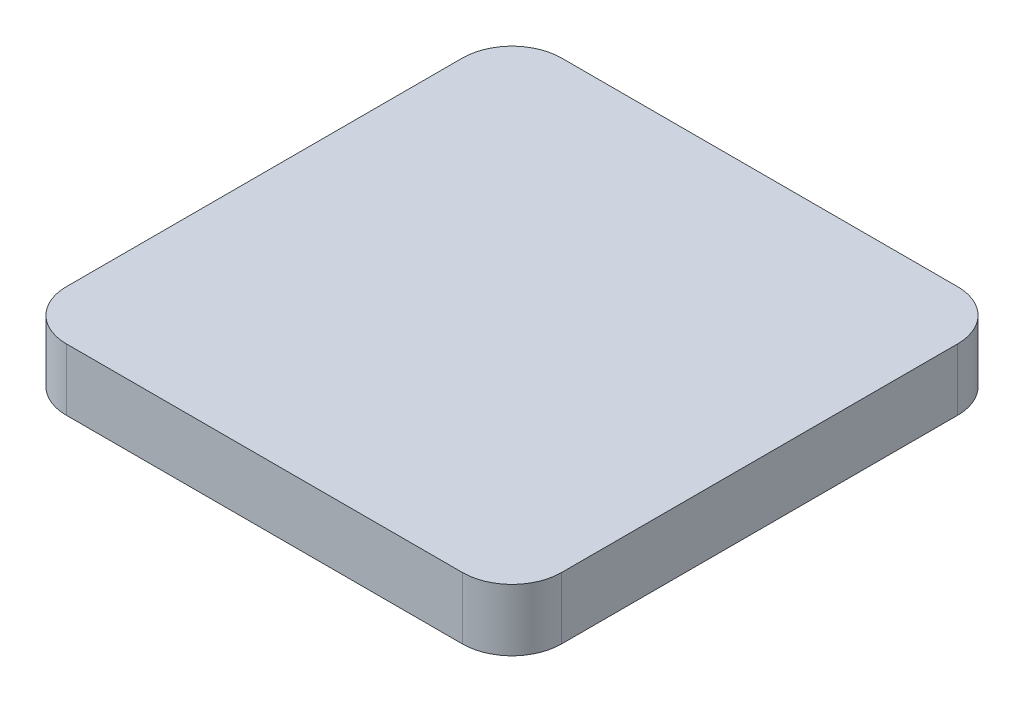
ISO-10303-21;
HEADER;
FILE_DESCRIPTION(('STEP AP214'),'2;1');
FILE_NAME('part.step','',(''),(''),'','','');
FILE_SCHEMA(('AUTOMOTIVE_DESIGN { 1 0 10303 214 1 1 1 1 }'));
ENDSEC;
DATA;
#1=APPLICATION_CONTEXT('core data for automotive mechanical design processes');
#2=APPLICATION_PROTOCOL_DEFINITION('international standard','automotive_design',2000,#1);
#3=PRODUCT_CONTEXT('',#1,'mechanical');
#4=PRODUCT('Part','Part','',(#3));
#5=PRODUCT_RELATED_PRODUCT_CATEGORY('part','',(#4));
#6=PRODUCT_DEFINITION_FORMATION('','',#4);
#7=PRODUCT_DEFINITION_CONTEXT('part definition',#1,'design');
#8=PRODUCT_DEFINITION('design','',#6,#7);
#9=PRODUCT_DEFINITION_SHAPE('','',#8);
#10=(LENGTH_UNIT() NAMED_UNIT(*) SI_UNIT(.MILLI.,.METRE.));
#11=(NAMED_UNIT(*) PLANE_ANGLE_UNIT() SI_UNIT($,.RADIAN.));
#12=(NAMED_UNIT(*) SI_UNIT($,.STERADIAN.) SOLID_ANGLE_UNIT());
#13=UNCERTAINTY_MEASURE_WITH_UNIT(LENGTH_MEASURE(1.E-05),#10,'distance_accuracy_value','');
#14=(GEOMETRIC_REPRESENTATION_CONTEXT(3) GLOBAL_UNCERTAINTY_ASSIGNED_CONTEXT((#13)) GLOBAL_UNIT_ASSIGNED_CONTEXT((#10,
#11,#12)) REPRESENTATION_CONTEXT('',''));
#15=CARTESIAN_POINT('',(0.,0.,0.));
#16=DIRECTION('',(0.,0.,1.));
#17=DIRECTION('',(1.,0.,0.));
#18=AXIS2_PLACEMENT_3D('',#15,#16,#17);
#19=CARTESIAN_POINT('',(12.7,3.175,-12.7));
#20=DIRECTION('',(-1.,0.,0.));
#21=DIRECTION('',(0.,0.,1.));
#22=AXIS2_PLACEMENT_3D('',#19,#20,#21);
#23=PLANE('',#22);
#24=DIRECTION('',(0.,0.,-1.));
#25=VECTOR('',#24,1.);
#26=CARTESIAN_POINT('',(12.7,0.,-12.7));
#27=LINE('',#26,#25);
#28=CARTESIAN_POINT('',(12.7,0.,10.16));
#29=VERTEX_POINT('',#28);
#30=CARTESIAN_POINT('',(12.7,0.,-10.16));
#31=VERTEX_POINT('',#30);
#32=EDGE_CURVE('E128',#29,#31,#27,.T.);
#33=ORIENTED_EDGE('',*,*,#32,.T.);
#34=DIRECTION('',(0.,-1.,0.));
#35=VECTOR('',#34,1.);
#36=CARTESIAN_POINT('',(12.7,3.175,-10.16));
#37=LINE('',#36,#35);
#38=CARTESIAN_POINT('',(12.7,3.175,-10.16));
#39=VERTEX_POINT('',#38);
#40=EDGE_CURVE('E106',#31,#39,#37,.F.);
#41=ORIENTED_EDGE('',*,*,#40,.T.);
#42=DIRECTION('',(0.,0.,-1.));
#43=VECTOR('',#42,1.);
#44=CARTESIAN_POINT('',(12.7,3.175,-12.7));
#45=LINE('',#44,#43);
#46=CARTESIAN_POINT('',(12.7,3.175,10.16));
#47=VERTEX_POINT('',#46);
#48=EDGE_CURVE('E137',#47,#39,#45,.T.);
#49=ORIENTED_EDGE('',*,*,#48,.F.);
#50=DIRECTION('',(0.,-1.,0.));
#51=VECTOR('',#50,1.);
#52=CARTESIAN_POINT('',(12.7,3.175,10.16));
#53=LINE('',#52,#51);
#54=EDGE_CURVE('E111',#47,#29,#53,.T.);
#55=ORIENTED_EDGE('',*,*,#54,.T.);
#56=EDGE_LOOP('',(#33,#41,#49,#55));
#57=FACE_BOUND('',#56,.T.);
#58=ADVANCED_FACE('F35',(#57),#23,.F.);
#59=CARTESIAN_POINT('',(-12.7,3.175,-12.7));
#60=DIRECTION('',(0.,0.,1.));
#61=DIRECTION('',(1.,0.,0.));
#62=AXIS2_PLACEMENT_3D('',#59,#60,#61);
#63=PLANE('',#62);
#64=DIRECTION('',(-1.,0.,0.));
#65=VECTOR('',#64,1.);
#66=CARTESIAN_POINT('',(-12.7,3.175,-12.7));
#67=LINE('',#66,#65);
#68=CARTESIAN_POINT('',(10.16,3.175,-12.7));
#69=VERTEX_POINT('',#68);
#70=CARTESIAN_POINT('',(-10.16,3.175,-12.7));
#71=VERTEX_POINT('',#70);
#72=EDGE_CURVE('E121',#69,#71,#67,.T.);
#73=ORIENTED_EDGE('',*,*,#72,.F.);
#74=DIRECTION('',(0.,-1.,0.));
#75=VECTOR('',#74,1.);
#76=CARTESIAN_POINT('',(10.16,3.175,-12.7));
#77=LINE('',#76,#75);
#78=CARTESIAN_POINT('',(10.16,0.,-12.7));
#79=VERTEX_POINT('',#78);
#80=EDGE_CURVE('E105',#69,#79,#77,.T.);
#81=ORIENTED_EDGE('',*,*,#80,.T.);
#82=DIRECTION('',(-1.,0.,0.));
#83=VECTOR('',#82,1.);
#84=CARTESIAN_POINT('',(-12.7,0.,-12.7));
#85=LINE('',#84,#83);
#86=CARTESIAN_POINT('',(-10.16,0.,-12.7));
#87=VERTEX_POINT('',#86);
#88=EDGE_CURVE('E118',#79,#87,#85,.T.);
#89=ORIENTED_EDGE('',*,*,#88,.T.);
#90=DIRECTION('',(0.,-1.,0.));
#91=VECTOR('',#90,1.);
#92=CARTESIAN_POINT('',(-10.16,3.175,-12.7));
#93=LINE('',#92,#91);
#94=EDGE_CURVE('E123',#87,#71,#93,.F.);
#95=ORIENTED_EDGE('',*,*,#94,.T.);
#96=EDGE_LOOP('',(#73,#81,#89,#95));
#97=FACE_BOUND('',#96,.T.);
#98=ADVANCED_FACE('F117',(#97),#63,.F.);
#99=CARTESIAN_POINT('',(-12.7,3.175,-12.7));
#100=DIRECTION('',(1.,0.,0.));
#101=DIRECTION('',(0.,0.,-1.));
#102=AXIS2_PLACEMENT_3D('',#99,#100,#101);
#103=PLANE('',#102);
#104=DIRECTION('',(0.,0.,1.));
#105=VECTOR('',#104,1.);
#106=CARTESIAN_POINT('',(-12.7,3.175,-12.7));
#107=LINE('',#106,#105);
#108=CARTESIAN_POINT('',(-12.7,3.175,-10.16));
#109=VERTEX_POINT('',#108);
#110=CARTESIAN_POINT('',(-12.7,3.175,10.16));
#111=VERTEX_POINT('',#110);
#112=EDGE_CURVE('E163',#109,#111,#107,.T.);
#113=ORIENTED_EDGE('',*,*,#112,.F.);
#114=DIRECTION('',(0.,-1.,0.));
#115=VECTOR('',#114,1.);
#116=CARTESIAN_POINT('',(-12.7,3.175,-10.16));
#117=LINE('',#116,#115);
#118=CARTESIAN_POINT('',(-12.7,0.,-10.16));
#119=VERTEX_POINT('',#118);
#120=EDGE_CURVE('E156',#109,#119,#117,.T.);
#121=ORIENTED_EDGE('',*,*,#120,.T.);
#122=DIRECTION('',(0.,0.,1.));
#123=VECTOR('',#122,1.);
#124=CARTESIAN_POINT('',(-12.7,0.,-12.7));
#125=LINE('',#124,#123);
#126=CARTESIAN_POINT('',(-12.7,0.,10.16));
#127=VERTEX_POINT('',#126);
#128=EDGE_CURVE('E127',#119,#127,#125,.T.);
#129=ORIENTED_EDGE('',*,*,#128,.T.);
#130=DIRECTION('',(0.,-1.,0.));
#131=VECTOR('',#130,1.);
#132=CARTESIAN_POINT('',(-12.7,3.175,10.16));
#133=LINE('',#132,#131);
#134=EDGE_CURVE('E154',#127,#111,#133,.F.);
#135=ORIENTED_EDGE('',*,*,#134,.T.);
#136=EDGE_LOOP('',(#113,#121,#129,#135));
#137=FACE_BOUND('',#136,.T.);
#138=ADVANCED_FACE('F161',(#137),#103,.F.);
#139=CARTESIAN_POINT('',(-12.7,3.175,12.7));
#140=DIRECTION('',(0.,0.,-1.));
#141=DIRECTION('',(-1.,0.,0.));
#142=AXIS2_PLACEMENT_3D('',#139,#140,#141);
#143=PLANE('',#142);
#144=DIRECTION('',(1.,0.,0.));
#145=VECTOR('',#144,1.);
#146=CARTESIAN_POINT('',(-12.7,3.175,12.7));
#147=LINE('',#146,#145);
#148=CARTESIAN_POINT('',(-10.16,3.175,12.7));
#149=VERTEX_POINT('',#148);
#150=CARTESIAN_POINT('',(10.16,3.175,12.7));
#151=VERTEX_POINT('',#150);
#152=EDGE_CURVE('E138',#149,#151,#147,.T.);
#153=ORIENTED_EDGE('',*,*,#152,.F.);
#154=DIRECTION('',(0.,-1.,0.));
#155=VECTOR('',#154,1.);
#156=CARTESIAN_POINT('',(-10.16,3.175,12.7));
#157=LINE('',#156,#155);
#158=CARTESIAN_POINT('',(-10.16,0.,12.7));
#159=VERTEX_POINT('',#158);
#160=EDGE_CURVE('E11',#149,#159,#157,.T.);
#161=ORIENTED_EDGE('',*,*,#160,.T.);
#162=DIRECTION('',(1.,0.,0.));
#163=VECTOR('',#162,1.);
#164=CARTESIAN_POINT('',(-12.7,0.,12.7));
#165=LINE('',#164,#163);
#166=CARTESIAN_POINT('',(10.16,0.,12.7));
#167=VERTEX_POINT('',#166);
#168=EDGE_CURVE('E131',#159,#167,#165,.T.);
#169=ORIENTED_EDGE('',*,*,#168,.T.);
#170=DIRECTION('',(0.,-1.,0.));
#171=VECTOR('',#170,1.);
#172=CARTESIAN_POINT('',(10.16,3.175,12.7));
#173=LINE('',#172,#171);
#174=EDGE_CURVE('E43',#167,#151,#173,.F.);
#175=ORIENTED_EDGE('',*,*,#174,.T.);
#176=EDGE_LOOP('',(#153,#161,#169,#175));
#177=FACE_BOUND('',#176,.T.);
#178=ADVANCED_FACE('F170',(#177),#143,.F.);
#179=CARTESIAN_POINT('',(0.,3.175,0.));
#180=DIRECTION('',(0.,1.,0.));
#181=DIRECTION('',(0.,0.,1.));
#182=AXIS2_PLACEMENT_3D('',#179,#180,#181);
#183=PLANE('',#182);
#184=ORIENTED_EDGE('',*,*,#48,.T.);
#185=CARTESIAN_POINT('',(10.16,3.175,-10.16));
#186=DIRECTION('',(0.,1.,0.));
#187=DIRECTION('',(0.,0.,1.));
#188=AXIS2_PLACEMENT_3D('',#185,#186,#187);
#189=CIRCLE('',#188,2.54);
#190=EDGE_CURVE('E152',#39,#69,#189,.T.);
#191=ORIENTED_EDGE('',*,*,#190,.T.);
#192=ORIENTED_EDGE('',*,*,#72,.T.);
#193=CARTESIAN_POINT('',(-10.16,3.175,-10.16));
#194=DIRECTION('',(0.,1.,0.));
#195=DIRECTION('',(0.,0.,1.));
#196=AXIS2_PLACEMENT_3D('',#193,#194,#195);
#197=CIRCLE('',#196,2.54);
#198=EDGE_CURVE('E150',#71,#109,#197,.T.);
#199=ORIENTED_EDGE('',*,*,#198,.T.);
#200=ORIENTED_EDGE('',*,*,#112,.T.);
#201=CARTESIAN_POINT('',(-10.16,3.175,10.16));
#202=DIRECTION('',(0.,1.,0.));
#203=DIRECTION('',(0.,0.,1.));
#204=AXIS2_PLACEMENT_3D('',#201,#202,#203);
#205=CIRCLE('',#204,2.54);
#206=EDGE_CURVE('E56',#111,#149,#205,.T.);
#207=ORIENTED_EDGE('',*,*,#206,.T.);
#208=ORIENTED_EDGE('',*,*,#152,.T.);
#209=CARTESIAN_POINT('',(10.16,3.175,10.16));
#210=DIRECTION('',(0.,1.,0.));
#211=DIRECTION('',(0.,0.,1.));
#212=AXIS2_PLACEMENT_3D('',#209,#210,#211);
#213=CIRCLE('',#212,2.54);
#214=EDGE_CURVE('E147',#151,#47,#213,.T.);
#215=ORIENTED_EDGE('',*,*,#214,.T.);
#216=EDGE_LOOP('',(#184,#191,#192,#199,#200,#207,#208,#215));
#217=FACE_BOUND('',#216,.T.);
#218=ADVANCED_FACE('F177',(#217),#183,.T.);
#219=CARTESIAN_POINT('',(0.,0.,0.));
#220=DIRECTION('',(0.,1.,0.));
#221=DIRECTION('',(0.,0.,1.));
#222=AXIS2_PLACEMENT_3D('',#219,#220,#221);
#223=PLANE('',#222);
#224=ORIENTED_EDGE('',*,*,#88,.F.);
#225=CARTESIAN_POINT('',(10.16,0.,-10.16));
#226=DIRECTION('',(0.,1.,0.));
#227=DIRECTION('',(0.,0.,1.));
#228=AXIS2_PLACEMENT_3D('',#225,#226,#227);
#229=CIRCLE('',#228,2.54);
#230=EDGE_CURVE('E101',#79,#31,#229,.F.);
#231=ORIENTED_EDGE('',*,*,#230,.T.);
#232=ORIENTED_EDGE('',*,*,#32,.F.);
#233=CARTESIAN_POINT('',(10.16,0.,10.16));
#234=DIRECTION('',(0.,1.,0.));
#235=DIRECTION('',(0.,0.,1.));
#236=AXIS2_PLACEMENT_3D('',#233,#234,#235);
#237=CIRCLE('',#236,2.54);
#238=EDGE_CURVE('E122',#29,#167,#237,.F.);
#239=ORIENTED_EDGE('',*,*,#238,.T.);
#240=ORIENTED_EDGE('',*,*,#168,.F.);
#241=CARTESIAN_POINT('',(-10.16,0.,10.16));
#242=DIRECTION('',(0.,1.,0.));
#243=DIRECTION('',(0.,0.,1.));
#244=AXIS2_PLACEMENT_3D('',#241,#242,#243);
#245=CIRCLE('',#244,2.54);
#246=EDGE_CURVE('E141',#159,#127,#245,.F.);
#247=ORIENTED_EDGE('',*,*,#246,.T.);
#248=ORIENTED_EDGE('',*,*,#128,.F.);
#249=CARTESIAN_POINT('',(-10.16,0.,-10.16));
#250=DIRECTION('',(0.,1.,0.));
#251=DIRECTION('',(0.,0.,1.));
#252=AXIS2_PLACEMENT_3D('',#249,#250,#251);
#253=CIRCLE('',#252,2.54);
#254=EDGE_CURVE('E112',#119,#87,#253,.F.);
#255=ORIENTED_EDGE('',*,*,#254,.T.);
#256=EDGE_LOOP('',(#224,#231,#232,#239,#240,#247,#248,#255));
#257=FACE_BOUND('',#256,.T.);
#258=ADVANCED_FACE('F125',(#257),#223,.F.);
#259=CARTESIAN_POINT('',(10.16,3.175,-10.16));
#260=DIRECTION('',(0.,-1.,0.));
#261=DIRECTION('',(0.,0.,-1.));
#262=AXIS2_PLACEMENT_3D('',#259,#260,#261);
#263=CYLINDRICAL_SURFACE('',#262,2.54);
#264=ORIENTED_EDGE('',*,*,#190,.F.);
#265=ORIENTED_EDGE('',*,*,#40,.F.);
#266=ORIENTED_EDGE('',*,*,#230,.F.);
#267=ORIENTED_EDGE('',*,*,#80,.F.);
#268=EDGE_LOOP('',(#264,#265,#266,#267));
#269=FACE_BOUND('',#268,.T.);
#270=ADVANCED_FACE('F104',(#269),#263,.T.);
#271=CARTESIAN_POINT('',(-10.16,3.175,-10.16));
#272=DIRECTION('',(0.,-1.,0.));
#273=DIRECTION('',(0.,0.,-1.));
#274=AXIS2_PLACEMENT_3D('',#271,#272,#273);
#275=CYLINDRICAL_SURFACE('',#274,2.54);
#276=ORIENTED_EDGE('',*,*,#198,.F.);
#277=ORIENTED_EDGE('',*,*,#94,.F.);
#278=ORIENTED_EDGE('',*,*,#254,.F.);
#279=ORIENTED_EDGE('',*,*,#120,.F.);
#280=EDGE_LOOP('',(#276,#277,#278,#279));
#281=FACE_BOUND('',#280,.T.);
#282=ADVANCED_FACE('F185',(#281),#275,.T.);
#283=CARTESIAN_POINT('',(-10.16,3.175,10.16));
#284=DIRECTION('',(0.,-1.,0.));
#285=DIRECTION('',(0.,0.,-1.));
#286=AXIS2_PLACEMENT_3D('',#283,#284,#285);
#287=CYLINDRICAL_SURFACE('',#286,2.54);
#288=ORIENTED_EDGE('',*,*,#206,.F.);
#289=ORIENTED_EDGE('',*,*,#134,.F.);
#290=ORIENTED_EDGE('',*,*,#246,.F.);
#291=ORIENTED_EDGE('',*,*,#160,.F.);
#292=EDGE_LOOP('',(#288,#289,#290,#291));
#293=FACE_BOUND('',#292,.T.);
#294=ADVANCED_FACE('F169',(#293),#287,.T.);
#295=CARTESIAN_POINT('',(10.16,3.175,10.16));
#296=DIRECTION('',(0.,-1.,0.));
#297=DIRECTION('',(0.,0.,-1.));
#298=AXIS2_PLACEMENT_3D('',#295,#296,#297);
#299=CYLINDRICAL_SURFACE('',#298,2.54);
#300=ORIENTED_EDGE('',*,*,#214,.F.);
#301=ORIENTED_EDGE('',*,*,#174,.F.);
#302=ORIENTED_EDGE('',*,*,#238,.F.);
#303=ORIENTED_EDGE('',*,*,#54,.F.);
#304=EDGE_LOOP('',(#300,#301,#302,#303));
#305=FACE_BOUND('',#304,.T.);
#306=ADVANCED_FACE('F37',(#305),#299,.T.);
#307=CLOSED_SHELL('',(#58,#98,#138,#178,#218,#258,#270,#282,#294,#306));
#308=MANIFOLD_SOLID_BREP('B2',#307);
#309=ADVANCED_BREP_SHAPE_REPRESENTATION('',(#18,#308),#14);
#310=SHAPE_DEFINITION_REPRESENTATION(#9,#309);
ENDSEC;
END-ISO-10303-21;
